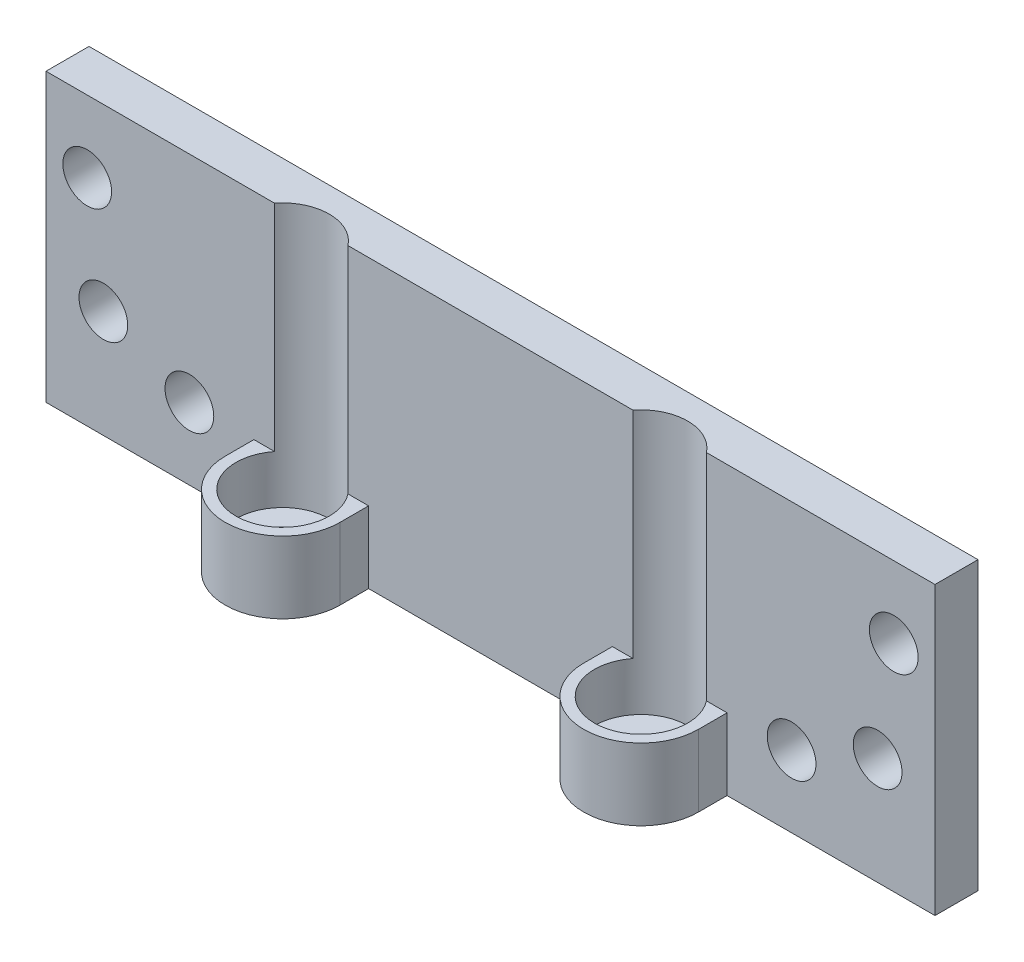
ISO-10303-21;
HEADER;
FILE_DESCRIPTION(('STEP AP214'),'2;1');
FILE_NAME('part.step','',(''),(''),'','','');
FILE_SCHEMA(('AUTOMOTIVE_DESIGN { 1 0 10303 214 1 1 1 1 }'));
ENDSEC;
DATA;
#1=APPLICATION_CONTEXT('core data for automotive mechanical design processes');
#2=APPLICATION_PROTOCOL_DEFINITION('international standard','automotive_design',2000,#1);
#3=PRODUCT_CONTEXT('',#1,'mechanical');
#4=PRODUCT('Part','Part','',(#3));
#5=PRODUCT_RELATED_PRODUCT_CATEGORY('part','',(#4));
#6=PRODUCT_DEFINITION_FORMATION('','',#4);
#7=PRODUCT_DEFINITION_CONTEXT('part definition',#1,'design');
#8=PRODUCT_DEFINITION('design','',#6,#7);
#9=PRODUCT_DEFINITION_SHAPE('','',#8);
#10=(LENGTH_UNIT() NAMED_UNIT(*) SI_UNIT(.MILLI.,.METRE.));
#11=(NAMED_UNIT(*) PLANE_ANGLE_UNIT() SI_UNIT($,.RADIAN.));
#12=(NAMED_UNIT(*) SI_UNIT($,.STERADIAN.) SOLID_ANGLE_UNIT());
#13=UNCERTAINTY_MEASURE_WITH_UNIT(LENGTH_MEASURE(1.E-05),#10,'distance_accuracy_value','');
#14=(GEOMETRIC_REPRESENTATION_CONTEXT(3) GLOBAL_UNCERTAINTY_ASSIGNED_CONTEXT((#13)) GLOBAL_UNIT_ASSIGNED_CONTEXT((#10,
#11,#12)) REPRESENTATION_CONTEXT('',''));
#15=CARTESIAN_POINT('',(0.,0.,0.));
#16=DIRECTION('',(0.,0.,1.));
#17=DIRECTION('',(1.,0.,0.));
#18=AXIS2_PLACEMENT_3D('',#15,#16,#17);
#19=CARTESIAN_POINT('',(16.5,20.,1.5));
#20=DIRECTION('',(0.,0.,-1.));
#21=DIRECTION('',(-1.,0.,0.));
#22=AXIS2_PLACEMENT_3D('',#19,#20,#21);
#23=PLANE('',#22);
#24=CARTESIAN_POINT('',(27.,7.5,1.5));
#25=DIRECTION('',(0.,0.,1.));
#26=DIRECTION('',(1.,0.,0.));
#27=AXIS2_PLACEMENT_3D('',#24,#25,#26);
#28=CIRCLE('',#27,1.69999999999999);
#29=CARTESIAN_POINT('',(28.7,7.5,1.5));
#30=VERTEX_POINT('',#29);
#31=EDGE_CURVE('E234',#30,#30,#28,.T.);
#32=ORIENTED_EDGE('',*,*,#31,.F.);
#33=EDGE_LOOP('',(#32));
#34=FACE_BOUND('',#33,.T.);
#35=DIRECTION('',(1.,0.,0.));
#36=VECTOR('',#35,1.);
#37=CARTESIAN_POINT('',(-31.,20.,1.5));
#38=LINE('',#37,#36);
#39=CARTESIAN_POINT('',(15.0617376914899,20.,1.5));
#40=VERTEX_POINT('',#39);
#41=CARTESIAN_POINT('',(31.,20.,1.5));
#42=VERTEX_POINT('',#41);
#43=EDGE_CURVE('E173',#40,#42,#38,.T.);
#44=ORIENTED_EDGE('',*,*,#43,.F.);
#45=DIRECTION('',(0.,-1.,0.));
#46=VECTOR('',#45,1.);
#47=CARTESIAN_POINT('',(15.0617376914899,25.2737557774322,1.5));
#48=LINE('',#47,#46);
#49=CARTESIAN_POINT('',(15.0617376914899,5.,1.5));
#50=VERTEX_POINT('',#49);
#51=EDGE_CURVE('E164',#40,#50,#48,.T.);
#52=ORIENTED_EDGE('',*,*,#51,.T.);
#53=DIRECTION('',(-1.,0.,0.));
#54=VECTOR('',#53,1.);
#55=CARTESIAN_POINT('',(-16.5,5.,1.5));
#56=LINE('',#55,#54);
#57=CARTESIAN_POINT('',(16.5,5.,1.5));
#58=VERTEX_POINT('',#57);
#59=EDGE_CURVE('E198',#58,#50,#56,.T.);
#60=ORIENTED_EDGE('',*,*,#59,.F.);
#61=DIRECTION('',(0.,-1.,0.));
#62=VECTOR('',#61,1.);
#63=CARTESIAN_POINT('',(16.5,20.,1.5));
#64=LINE('',#63,#62);
#65=CARTESIAN_POINT('',(16.5,0.,1.5));
#66=VERTEX_POINT('',#65);
#67=EDGE_CURVE('E175',#58,#66,#64,.T.);
#68=ORIENTED_EDGE('',*,*,#67,.T.);
#69=DIRECTION('',(1.,0.,0.));
#70=VECTOR('',#69,1.);
#71=CARTESIAN_POINT('',(16.5,0.,1.5));
#72=LINE('',#71,#70);
#73=CARTESIAN_POINT('',(31.,0.,1.5));
#74=VERTEX_POINT('',#73);
#75=EDGE_CURVE('E188',#66,#74,#72,.T.);
#76=ORIENTED_EDGE('',*,*,#75,.T.);
#77=DIRECTION('',(0.,-1.,0.));
#78=VECTOR('',#77,1.);
#79=CARTESIAN_POINT('',(31.,20.,1.5));
#80=LINE('',#79,#78);
#81=EDGE_CURVE('E170',#42,#74,#80,.T.);
#82=ORIENTED_EDGE('',*,*,#81,.F.);
#83=EDGE_LOOP('',(#44,#52,#60,#68,#76,#82));
#84=FACE_BOUND('',#83,.T.);
#85=CARTESIAN_POINT('',(21.,5.00000000000005,1.5));
#86=DIRECTION('',(0.,0.,1.));
#87=DIRECTION('',(1.,0.,0.));
#88=AXIS2_PLACEMENT_3D('',#85,#86,#87);
#89=CIRCLE('',#88,1.69999999999999);
#90=CARTESIAN_POINT('',(22.7,5.00000000000005,1.5));
#91=VERTEX_POINT('',#90);
#92=EDGE_CURVE('E246',#91,#91,#89,.T.);
#93=ORIENTED_EDGE('',*,*,#92,.F.);
#94=EDGE_LOOP('',(#93));
#95=FACE_BOUND('',#94,.T.);
#96=CARTESIAN_POINT('',(28.125,15.,1.5));
#97=DIRECTION('',(0.,0.,1.));
#98=DIRECTION('',(1.,0.,0.));
#99=AXIS2_PLACEMENT_3D('',#96,#97,#98);
#100=CIRCLE('',#99,1.69999999999999);
#101=CARTESIAN_POINT('',(29.825,15.,1.5));
#102=VERTEX_POINT('',#101);
#103=EDGE_CURVE('E258',#102,#102,#100,.T.);
#104=ORIENTED_EDGE('',*,*,#103,.F.);
#105=EDGE_LOOP('',(#104));
#106=FACE_BOUND('',#105,.T.);
#107=ADVANCED_FACE('F34',(#34,#84,#95,#106),#23,.F.);
#108=CARTESIAN_POINT('',(-9.9382623085101,20.,1.5));
#109=VERTEX_POINT('',#108);
#110=CARTESIAN_POINT('',(9.93826230851011,20.,1.5));
#111=VERTEX_POINT('',#110);
#112=EDGE_CURVE('E171',#109,#111,#38,.T.);
#113=ORIENTED_EDGE('',*,*,#112,.F.);
#114=DIRECTION('',(0.,-1.,0.));
#115=VECTOR('',#114,1.);
#116=CARTESIAN_POINT('',(-9.9382623085101,25.2737557774322,1.5));
#117=LINE('',#116,#115);
#118=CARTESIAN_POINT('',(-9.9382623085101,5.,1.5));
#119=VERTEX_POINT('',#118);
#120=EDGE_CURVE('E150',#109,#119,#117,.T.);
#121=ORIENTED_EDGE('',*,*,#120,.T.);
#122=CARTESIAN_POINT('',(-8.5,5.,1.5));
#123=VERTEX_POINT('',#122);
#124=EDGE_CURVE('E202',#123,#119,#56,.T.);
#125=ORIENTED_EDGE('',*,*,#124,.F.);
#126=DIRECTION('',(0.,-1.,0.));
#127=VECTOR('',#126,1.);
#128=CARTESIAN_POINT('',(-8.5,20.,1.5));
#129=LINE('',#128,#127);
#130=CARTESIAN_POINT('',(-8.5,0.,1.5));
#131=VERTEX_POINT('',#130);
#132=EDGE_CURVE('E400',#123,#131,#129,.T.);
#133=ORIENTED_EDGE('',*,*,#132,.T.);
#134=DIRECTION('',(1.,0.,0.));
#135=VECTOR('',#134,1.);
#136=CARTESIAN_POINT('',(-8.5,0.,1.5));
#137=LINE('',#136,#135);
#138=CARTESIAN_POINT('',(8.5,0.,1.5));
#139=VERTEX_POINT('',#138);
#140=EDGE_CURVE('E380',#131,#139,#137,.T.);
#141=ORIENTED_EDGE('',*,*,#140,.T.);
#142=DIRECTION('',(0.,-1.,0.));
#143=VECTOR('',#142,1.);
#144=CARTESIAN_POINT('',(8.5,20.,1.5));
#145=LINE('',#144,#143);
#146=CARTESIAN_POINT('',(8.5,5.,1.5));
#147=VERTEX_POINT('',#146);
#148=EDGE_CURVE('E398',#147,#139,#145,.T.);
#149=ORIENTED_EDGE('',*,*,#148,.F.);
#150=CARTESIAN_POINT('',(9.93826230851011,5.,1.5));
#151=VERTEX_POINT('',#150);
#152=EDGE_CURVE('E201',#151,#147,#56,.T.);
#153=ORIENTED_EDGE('',*,*,#152,.F.);
#154=DIRECTION('',(0.,-1.,0.));
#155=VECTOR('',#154,1.);
#156=CARTESIAN_POINT('',(9.93826230851011,25.2737557774322,1.5));
#157=LINE('',#156,#155);
#158=EDGE_CURVE('E58',#111,#151,#157,.T.);
#159=ORIENTED_EDGE('',*,*,#158,.F.);
#160=EDGE_LOOP('',(#113,#121,#125,#133,#141,#149,#153,#159));
#161=FACE_BOUND('',#160,.T.);
#162=ADVANCED_FACE('F274',(#161),#23,.F.);
#163=CARTESIAN_POINT('',(-16.5,20.,1.5));
#164=DIRECTION('',(1.,0.,0.));
#165=DIRECTION('',(0.,0.,-1.));
#166=AXIS2_PLACEMENT_3D('',#163,#164,#165);
#167=PLANE('',#166);
#168=DIRECTION('',(0.,0.,1.));
#169=VECTOR('',#168,1.);
#170=CARTESIAN_POINT('',(-16.5,5.,1.5));
#171=LINE('',#170,#169);
#172=CARTESIAN_POINT('',(-16.5,5.,1.5));
#173=VERTEX_POINT('',#172);
#174=CARTESIAN_POINT('',(-16.5,5.,3.5));
#175=VERTEX_POINT('',#174);
#176=EDGE_CURVE('E205',#173,#175,#171,.T.);
#177=ORIENTED_EDGE('',*,*,#176,.F.);
#178=DIRECTION('',(0.,-1.,0.));
#179=VECTOR('',#178,1.);
#180=CARTESIAN_POINT('',(-16.5,20.,1.5));
#181=LINE('',#180,#179);
#182=CARTESIAN_POINT('',(-16.5,0.,1.5));
#183=VERTEX_POINT('',#182);
#184=EDGE_CURVE('E406',#173,#183,#181,.T.);
#185=ORIENTED_EDGE('',*,*,#184,.T.);
#186=DIRECTION('',(0.,0.,1.));
#187=VECTOR('',#186,1.);
#188=CARTESIAN_POINT('',(-16.5,0.,1.5));
#189=LINE('',#188,#187);
#190=CARTESIAN_POINT('',(-16.5,0.,3.5));
#191=VERTEX_POINT('',#190);
#192=EDGE_CURVE('E369',#183,#191,#189,.T.);
#193=ORIENTED_EDGE('',*,*,#192,.T.);
#194=DIRECTION('',(0.,-1.,0.));
#195=VECTOR('',#194,1.);
#196=CARTESIAN_POINT('',(-16.5,20.,3.5));
#197=LINE('',#196,#195);
#198=EDGE_CURVE('E404',#175,#191,#197,.T.);
#199=ORIENTED_EDGE('',*,*,#198,.F.);
#200=EDGE_LOOP('',(#177,#185,#193,#199));
#201=FACE_BOUND('',#200,.T.);
#202=ADVANCED_FACE('F300',(#201),#167,.F.);
#203=CARTESIAN_POINT('',(-12.5,20.,3.5));
#204=DIRECTION('',(0.,-1.,0.));
#205=DIRECTION('',(0.,0.,-1.));
#206=AXIS2_PLACEMENT_3D('',#203,#204,#205);
#207=CYLINDRICAL_SURFACE('',#206,4.);
#208=DIRECTION('',(0.,-1.,0.));
#209=VECTOR('',#208,1.);
#210=CARTESIAN_POINT('',(-8.5,20.,3.5));
#211=LINE('',#210,#209);
#212=CARTESIAN_POINT('',(-8.5,5.,3.5));
#213=VERTEX_POINT('',#212);
#214=CARTESIAN_POINT('',(-8.5,0.,3.5));
#215=VERTEX_POINT('',#214);
#216=EDGE_CURVE('E402',#213,#215,#211,.T.);
#217=ORIENTED_EDGE('',*,*,#216,.F.);
#218=CARTESIAN_POINT('',(-12.5,5.,3.5));
#219=DIRECTION('',(0.,1.,0.));
#220=DIRECTION('',(0.,0.,1.));
#221=AXIS2_PLACEMENT_3D('',#218,#219,#220);
#222=CIRCLE('',#221,4.);
#223=EDGE_CURVE('E189',#175,#213,#222,.T.);
#224=ORIENTED_EDGE('',*,*,#223,.F.);
#225=ORIENTED_EDGE('',*,*,#198,.T.);
#226=CARTESIAN_POINT('',(-12.5,0.,3.5));
#227=DIRECTION('',(0.,1.,0.));
#228=DIRECTION('',(0.,0.,1.));
#229=AXIS2_PLACEMENT_3D('',#226,#227,#228);
#230=CIRCLE('',#229,4.);
#231=EDGE_CURVE('E374',#191,#215,#230,.T.);
#232=ORIENTED_EDGE('',*,*,#231,.T.);
#233=EDGE_LOOP('',(#217,#224,#225,#232));
#234=FACE_BOUND('',#233,.T.);
#235=ADVANCED_FACE('F323',(#234),#207,.T.);
#236=CARTESIAN_POINT('',(-8.5,20.,3.5));
#237=DIRECTION('',(-1.,0.,0.));
#238=DIRECTION('',(0.,0.,1.));
#239=AXIS2_PLACEMENT_3D('',#236,#237,#238);
#240=PLANE('',#239);
#241=DIRECTION('',(0.,0.,-1.));
#242=VECTOR('',#241,1.);
#243=CARTESIAN_POINT('',(-8.5,5.,3.5));
#244=LINE('',#243,#242);
#245=EDGE_CURVE('E192',#213,#123,#244,.T.);
#246=ORIENTED_EDGE('',*,*,#245,.F.);
#247=ORIENTED_EDGE('',*,*,#216,.T.);
#248=DIRECTION('',(0.,0.,-1.));
#249=VECTOR('',#248,1.);
#250=CARTESIAN_POINT('',(-8.5,0.,3.5));
#251=LINE('',#250,#249);
#252=EDGE_CURVE('E377',#215,#131,#251,.T.);
#253=ORIENTED_EDGE('',*,*,#252,.T.);
#254=ORIENTED_EDGE('',*,*,#132,.F.);
#255=EDGE_LOOP('',(#246,#247,#253,#254));
#256=FACE_BOUND('',#255,.T.);
#257=ADVANCED_FACE('F319',(#256),#240,.F.);
#258=CARTESIAN_POINT('',(8.5,20.,1.5));
#259=DIRECTION('',(1.,0.,0.));
#260=DIRECTION('',(0.,0.,-1.));
#261=AXIS2_PLACEMENT_3D('',#258,#259,#260);
#262=PLANE('',#261);
#263=DIRECTION('',(0.,0.,1.));
#264=VECTOR('',#263,1.);
#265=CARTESIAN_POINT('',(8.5,5.,1.5));
#266=LINE('',#265,#264);
#267=CARTESIAN_POINT('',(8.5,5.,3.5));
#268=VERTEX_POINT('',#267);
#269=EDGE_CURVE('E194',#147,#268,#266,.T.);
#270=ORIENTED_EDGE('',*,*,#269,.F.);
#271=ORIENTED_EDGE('',*,*,#148,.T.);
#272=DIRECTION('',(0.,0.,1.));
#273=VECTOR('',#272,1.);
#274=CARTESIAN_POINT('',(8.5,0.,1.5));
#275=LINE('',#274,#273);
#276=CARTESIAN_POINT('',(8.5,0.,3.5));
#277=VERTEX_POINT('',#276);
#278=EDGE_CURVE('E383',#139,#277,#275,.T.);
#279=ORIENTED_EDGE('',*,*,#278,.T.);
#280=DIRECTION('',(0.,-1.,0.));
#281=VECTOR('',#280,1.);
#282=CARTESIAN_POINT('',(8.5,20.,3.5));
#283=LINE('',#282,#281);
#284=EDGE_CURVE('E396',#268,#277,#283,.T.);
#285=ORIENTED_EDGE('',*,*,#284,.F.);
#286=EDGE_LOOP('',(#270,#271,#279,#285));
#287=FACE_BOUND('',#286,.T.);
#288=ADVANCED_FACE('F315',(#287),#262,.F.);
#289=CARTESIAN_POINT('',(12.5,20.,3.5));
#290=DIRECTION('',(0.,-1.,0.));
#291=DIRECTION('',(0.,0.,-1.));
#292=AXIS2_PLACEMENT_3D('',#289,#290,#291);
#293=CYLINDRICAL_SURFACE('',#292,4.);
#294=DIRECTION('',(0.,-1.,0.));
#295=VECTOR('',#294,1.);
#296=CARTESIAN_POINT('',(16.5,20.,3.5));
#297=LINE('',#296,#295);
#298=CARTESIAN_POINT('',(16.5,5.,3.5));
#299=VERTEX_POINT('',#298);
#300=CARTESIAN_POINT('',(16.5,0.,3.5));
#301=VERTEX_POINT('',#300);
#302=EDGE_CURVE('E394',#299,#301,#297,.T.);
#303=ORIENTED_EDGE('',*,*,#302,.F.);
#304=CARTESIAN_POINT('',(12.5,5.,3.5));
#305=DIRECTION('',(0.,1.,0.));
#306=DIRECTION('',(0.,0.,1.));
#307=AXIS2_PLACEMENT_3D('',#304,#305,#306);
#308=CIRCLE('',#307,4.);
#309=EDGE_CURVE('E196',#268,#299,#308,.T.);
#310=ORIENTED_EDGE('',*,*,#309,.F.);
#311=ORIENTED_EDGE('',*,*,#284,.T.);
#312=CARTESIAN_POINT('',(12.5,0.,3.5));
#313=DIRECTION('',(0.,1.,0.));
#314=DIRECTION('',(0.,0.,1.));
#315=AXIS2_PLACEMENT_3D('',#312,#313,#314);
#316=CIRCLE('',#315,4.);
#317=EDGE_CURVE('E386',#277,#301,#316,.T.);
#318=ORIENTED_EDGE('',*,*,#317,.T.);
#319=EDGE_LOOP('',(#303,#310,#311,#318));
#320=FACE_BOUND('',#319,.T.);
#321=ADVANCED_FACE('F311',(#320),#293,.T.);
#322=CARTESIAN_POINT('',(16.5,20.,3.5));
#323=DIRECTION('',(-1.,0.,0.));
#324=DIRECTION('',(0.,0.,1.));
#325=AXIS2_PLACEMENT_3D('',#322,#323,#324);
#326=PLANE('',#325);
#327=DIRECTION('',(0.,0.,-1.));
#328=VECTOR('',#327,1.);
#329=CARTESIAN_POINT('',(16.5,5.,1.5));
#330=LINE('',#329,#328);
#331=EDGE_CURVE('E203',#299,#58,#330,.T.);
#332=ORIENTED_EDGE('',*,*,#331,.F.);
#333=ORIENTED_EDGE('',*,*,#302,.T.);
#334=DIRECTION('',(0.,0.,-1.));
#335=VECTOR('',#334,1.);
#336=CARTESIAN_POINT('',(16.5,0.,3.5));
#337=LINE('',#336,#335);
#338=EDGE_CURVE('E389',#301,#66,#337,.T.);
#339=ORIENTED_EDGE('',*,*,#338,.T.);
#340=ORIENTED_EDGE('',*,*,#67,.F.);
#341=EDGE_LOOP('',(#332,#333,#339,#340));
#342=FACE_BOUND('',#341,.T.);
#343=ADVANCED_FACE('F308',(#342),#326,.F.);
#344=CARTESIAN_POINT('',(31.,20.,1.5));
#345=DIRECTION('',(-1.,0.,0.));
#346=DIRECTION('',(0.,0.,1.));
#347=AXIS2_PLACEMENT_3D('',#344,#345,#346);
#348=PLANE('',#347);
#349=DIRECTION('',(0.,0.,-1.));
#350=VECTOR('',#349,1.);
#351=CARTESIAN_POINT('',(31.,0.,1.5));
#352=LINE('',#351,#350);
#353=CARTESIAN_POINT('',(31.,0.,-1.5));
#354=VERTEX_POINT('',#353);
#355=EDGE_CURVE('E191',#74,#354,#352,.T.);
#356=ORIENTED_EDGE('',*,*,#355,.T.);
#357=DIRECTION('',(0.,-1.,0.));
#358=VECTOR('',#357,1.);
#359=CARTESIAN_POINT('',(31.,20.,-1.5));
#360=LINE('',#359,#358);
#361=CARTESIAN_POINT('',(31.,20.,-1.5));
#362=VERTEX_POINT('',#361);
#363=EDGE_CURVE('E38',#362,#354,#360,.T.);
#364=ORIENTED_EDGE('',*,*,#363,.F.);
#365=DIRECTION('',(0.,0.,-1.));
#366=VECTOR('',#365,1.);
#367=CARTESIAN_POINT('',(31.,20.,1.5));
#368=LINE('',#367,#366);
#369=EDGE_CURVE('E184',#42,#362,#368,.T.);
#370=ORIENTED_EDGE('',*,*,#369,.F.);
#371=ORIENTED_EDGE('',*,*,#81,.T.);
#372=EDGE_LOOP('',(#356,#364,#370,#371));
#373=FACE_BOUND('',#372,.T.);
#374=ADVANCED_FACE('F36',(#373),#348,.F.);
#375=CARTESIAN_POINT('',(-31.,20.,-1.5));
#376=DIRECTION('',(0.,0.,1.));
#377=DIRECTION('',(1.,0.,0.));
#378=AXIS2_PLACEMENT_3D('',#375,#376,#377);
#379=PLANE('',#378);
#380=CARTESIAN_POINT('',(-28.125,15.,-1.5));
#381=DIRECTION('',(0.,0.,1.));
#382=DIRECTION('',(1.,0.,0.));
#383=AXIS2_PLACEMENT_3D('',#380,#381,#382);
#384=CIRCLE('',#383,1.69999999999999);
#385=CARTESIAN_POINT('',(-26.425,15.,-1.5));
#386=VERTEX_POINT('',#385);
#387=EDGE_CURVE('E261',#386,#386,#384,.T.);
#388=ORIENTED_EDGE('',*,*,#387,.T.);
#389=EDGE_LOOP('',(#388));
#390=FACE_BOUND('',#389,.T.);
#391=CARTESIAN_POINT('',(28.125,15.,-1.5));
#392=DIRECTION('',(0.,0.,1.));
#393=DIRECTION('',(1.,0.,0.));
#394=AXIS2_PLACEMENT_3D('',#391,#392,#393);
#395=CIRCLE('',#394,1.69999999999999);
#396=CARTESIAN_POINT('',(29.825,15.,-1.5));
#397=VERTEX_POINT('',#396);
#398=EDGE_CURVE('E255',#397,#397,#395,.T.);
#399=ORIENTED_EDGE('',*,*,#398,.T.);
#400=EDGE_LOOP('',(#399));
#401=FACE_BOUND('',#400,.T.);
#402=CARTESIAN_POINT('',(-21.,5.,-1.5));
#403=DIRECTION('',(0.,0.,1.));
#404=DIRECTION('',(1.,0.,0.));
#405=AXIS2_PLACEMENT_3D('',#402,#403,#404);
#406=CIRCLE('',#405,1.69999999999999);
#407=CARTESIAN_POINT('',(-19.3,5.,-1.5));
#408=VERTEX_POINT('',#407);
#409=EDGE_CURVE('E249',#408,#408,#406,.T.);
#410=ORIENTED_EDGE('',*,*,#409,.T.);
#411=EDGE_LOOP('',(#410));
#412=FACE_BOUND('',#411,.T.);
#413=CARTESIAN_POINT('',(21.,5.00000000000005,-1.5));
#414=DIRECTION('',(0.,0.,1.));
#415=DIRECTION('',(1.,0.,0.));
#416=AXIS2_PLACEMENT_3D('',#413,#414,#415);
#417=CIRCLE('',#416,1.69999999999999);
#418=CARTESIAN_POINT('',(22.7,5.00000000000005,-1.5));
#419=VERTEX_POINT('',#418);
#420=EDGE_CURVE('E243',#419,#419,#417,.T.);
#421=ORIENTED_EDGE('',*,*,#420,.T.);
#422=EDGE_LOOP('',(#421));
#423=FACE_BOUND('',#422,.T.);
#424=CARTESIAN_POINT('',(-27.,7.5,-1.5));
#425=DIRECTION('',(0.,0.,1.));
#426=DIRECTION('',(1.,0.,0.));
#427=AXIS2_PLACEMENT_3D('',#424,#425,#426);
#428=CIRCLE('',#427,1.69999999999999);
#429=CARTESIAN_POINT('',(-25.3,7.5,-1.5));
#430=VERTEX_POINT('',#429);
#431=EDGE_CURVE('E237',#430,#430,#428,.T.);
#432=ORIENTED_EDGE('',*,*,#431,.T.);
#433=EDGE_LOOP('',(#432));
#434=FACE_BOUND('',#433,.T.);
#435=CARTESIAN_POINT('',(27.,7.5,-1.5));
#436=DIRECTION('',(0.,0.,1.));
#437=DIRECTION('',(1.,0.,0.));
#438=AXIS2_PLACEMENT_3D('',#435,#436,#437);
#439=CIRCLE('',#438,1.69999999999999);
#440=CARTESIAN_POINT('',(28.7,7.5,-1.5));
#441=VERTEX_POINT('',#440);
#442=EDGE_CURVE('E229',#441,#441,#439,.T.);
#443=ORIENTED_EDGE('',*,*,#442,.T.);
#444=EDGE_LOOP('',(#443));
#445=FACE_BOUND('',#444,.T.);
#446=DIRECTION('',(-1.,0.,0.));
#447=VECTOR('',#446,1.);
#448=CARTESIAN_POINT('',(-31.,0.,-1.5));
#449=LINE('',#448,#447);
#450=CARTESIAN_POINT('',(-31.,0.,-1.5));
#451=VERTEX_POINT('',#450);
#452=EDGE_CURVE('E353',#354,#451,#449,.T.);
#453=ORIENTED_EDGE('',*,*,#452,.T.);
#454=DIRECTION('',(0.,-1.,0.));
#455=VECTOR('',#454,1.);
#456=CARTESIAN_POINT('',(-31.,20.,-1.5));
#457=LINE('',#456,#455);
#458=CARTESIAN_POINT('',(-31.,20.,-1.5));
#459=VERTEX_POINT('',#458);
#460=EDGE_CURVE('E355',#459,#451,#457,.T.);
#461=ORIENTED_EDGE('',*,*,#460,.F.);
#462=DIRECTION('',(-1.,0.,0.));
#463=VECTOR('',#462,1.);
#464=CARTESIAN_POINT('',(-31.,20.,-1.5));
#465=LINE('',#464,#463);
#466=EDGE_CURVE('E183',#362,#459,#465,.T.);
#467=ORIENTED_EDGE('',*,*,#466,.F.);
#468=ORIENTED_EDGE('',*,*,#363,.T.);
#469=EDGE_LOOP('',(#453,#461,#467,#468));
#470=FACE_BOUND('',#469,.T.);
#471=ADVANCED_FACE('F332',(#390,#401,#412,#423,#434,#445,#470),#379,.F.);
#472=CARTESIAN_POINT('',(-31.,20.,1.5));
#473=DIRECTION('',(1.,0.,0.));
#474=DIRECTION('',(0.,0.,-1.));
#475=AXIS2_PLACEMENT_3D('',#472,#473,#474);
#476=PLANE('',#475);
#477=DIRECTION('',(0.,0.,1.));
#478=VECTOR('',#477,1.);
#479=CARTESIAN_POINT('',(-31.,0.,1.5));
#480=LINE('',#479,#478);
#481=CARTESIAN_POINT('',(-31.,0.,1.5));
#482=VERTEX_POINT('',#481);
#483=EDGE_CURVE('E361',#451,#482,#480,.T.);
#484=ORIENTED_EDGE('',*,*,#483,.T.);
#485=DIRECTION('',(0.,-1.,0.));
#486=VECTOR('',#485,1.);
#487=CARTESIAN_POINT('',(-31.,20.,1.5));
#488=LINE('',#487,#486);
#489=CARTESIAN_POINT('',(-31.,20.,1.5));
#490=VERTEX_POINT('',#489);
#491=EDGE_CURVE('E363',#490,#482,#488,.T.);
#492=ORIENTED_EDGE('',*,*,#491,.F.);
#493=DIRECTION('',(0.,0.,1.));
#494=VECTOR('',#493,1.);
#495=CARTESIAN_POINT('',(-31.,20.,1.5));
#496=LINE('',#495,#494);
#497=EDGE_CURVE('E168',#459,#490,#496,.T.);
#498=ORIENTED_EDGE('',*,*,#497,.F.);
#499=ORIENTED_EDGE('',*,*,#460,.T.);
#500=EDGE_LOOP('',(#484,#492,#498,#499));
#501=FACE_BOUND('',#500,.T.);
#502=ADVANCED_FACE('F272',(#501),#476,.F.);
#503=CARTESIAN_POINT('',(-28.125,15.,1.5));
#504=DIRECTION('',(0.,0.,1.));
#505=DIRECTION('',(1.,0.,0.));
#506=AXIS2_PLACEMENT_3D('',#503,#504,#505);
#507=CIRCLE('',#506,1.69999999999999);
#508=CARTESIAN_POINT('',(-26.425,15.,1.5));
#509=VERTEX_POINT('',#508);
#510=EDGE_CURVE('E264',#509,#509,#507,.T.);
#511=ORIENTED_EDGE('',*,*,#510,.F.);
#512=EDGE_LOOP('',(#511));
#513=FACE_BOUND('',#512,.T.);
#514=CARTESIAN_POINT('',(-21.,5.,1.5));
#515=DIRECTION('',(0.,0.,1.));
#516=DIRECTION('',(1.,0.,0.));
#517=AXIS2_PLACEMENT_3D('',#514,#515,#516);
#518=CIRCLE('',#517,1.69999999999999);
#519=CARTESIAN_POINT('',(-19.3,5.,1.5));
#520=VERTEX_POINT('',#519);
#521=EDGE_CURVE('E252',#520,#520,#518,.T.);
#522=ORIENTED_EDGE('',*,*,#521,.F.);
#523=EDGE_LOOP('',(#522));
#524=FACE_BOUND('',#523,.T.);
#525=CARTESIAN_POINT('',(-27.,7.5,1.5));
#526=DIRECTION('',(0.,0.,1.));
#527=DIRECTION('',(1.,0.,0.));
#528=AXIS2_PLACEMENT_3D('',#525,#526,#527);
#529=CIRCLE('',#528,1.69999999999999);
#530=CARTESIAN_POINT('',(-25.3,7.5,1.5));
#531=VERTEX_POINT('',#530);
#532=EDGE_CURVE('E240',#531,#531,#529,.T.);
#533=ORIENTED_EDGE('',*,*,#532,.F.);
#534=EDGE_LOOP('',(#533));
#535=FACE_BOUND('',#534,.T.);
#536=CARTESIAN_POINT('',(-15.0617376914899,5.,1.5));
#537=VERTEX_POINT('',#536);
#538=EDGE_CURVE('E163',#537,#173,#56,.T.);
#539=ORIENTED_EDGE('',*,*,#538,.F.);
#540=DIRECTION('',(0.,-1.,0.));
#541=VECTOR('',#540,1.);
#542=CARTESIAN_POINT('',(-15.0617376914899,25.2737557774322,1.5));
#543=LINE('',#542,#541);
#544=CARTESIAN_POINT('',(-15.0617376914899,20.,1.5));
#545=VERTEX_POINT('',#544);
#546=EDGE_CURVE('E50',#545,#537,#543,.T.);
#547=ORIENTED_EDGE('',*,*,#546,.F.);
#548=EDGE_CURVE('E161',#490,#545,#38,.T.);
#549=ORIENTED_EDGE('',*,*,#548,.F.);
#550=ORIENTED_EDGE('',*,*,#491,.T.);
#551=DIRECTION('',(1.,0.,0.));
#552=VECTOR('',#551,1.);
#553=CARTESIAN_POINT('',(-31.,0.,1.5));
#554=LINE('',#553,#552);
#555=EDGE_CURVE('E367',#482,#183,#554,.T.);
#556=ORIENTED_EDGE('',*,*,#555,.T.);
#557=ORIENTED_EDGE('',*,*,#184,.F.);
#558=EDGE_LOOP('',(#539,#547,#549,#550,#556,#557));
#559=FACE_BOUND('',#558,.T.);
#560=ADVANCED_FACE('F159',(#513,#524,#535,#559),#23,.F.);
#561=CARTESIAN_POINT('',(-12.5,20.,3.5));
#562=DIRECTION('',(0.,1.,0.));
#563=DIRECTION('',(0.,0.,1.));
#564=AXIS2_PLACEMENT_3D('',#561,#562,#563);
#565=PLANE('',#564);
#566=CARTESIAN_POINT('',(-12.5,20.,3.5));
#567=DIRECTION('',(0.,1.,0.));
#568=DIRECTION('',(0.,0.,1.));
#569=AXIS2_PLACEMENT_3D('',#566,#567,#568);
#570=CIRCLE('',#569,3.25);
#571=EDGE_CURVE('E148',#545,#109,#570,.F.);
#572=ORIENTED_EDGE('',*,*,#571,.T.);
#573=ORIENTED_EDGE('',*,*,#112,.T.);
#574=CARTESIAN_POINT('',(12.5,20.,3.5));
#575=DIRECTION('',(0.,1.,0.));
#576=DIRECTION('',(0.,0.,1.));
#577=AXIS2_PLACEMENT_3D('',#574,#575,#576);
#578=CIRCLE('',#577,3.25);
#579=EDGE_CURVE('E227',#111,#40,#578,.F.);
#580=ORIENTED_EDGE('',*,*,#579,.T.);
#581=ORIENTED_EDGE('',*,*,#43,.T.);
#582=ORIENTED_EDGE('',*,*,#369,.T.);
#583=ORIENTED_EDGE('',*,*,#466,.T.);
#584=ORIENTED_EDGE('',*,*,#497,.T.);
#585=ORIENTED_EDGE('',*,*,#548,.T.);
#586=EDGE_LOOP('',(#572,#573,#580,#581,#582,#583,#584,#585));
#587=FACE_BOUND('',#586,.T.);
#588=ADVANCED_FACE('F166',(#587),#565,.T.);
#589=CARTESIAN_POINT('',(-12.5,0.,3.5));
#590=DIRECTION('',(0.,1.,0.));
#591=DIRECTION('',(0.,0.,1.));
#592=AXIS2_PLACEMENT_3D('',#589,#590,#591);
#593=PLANE('',#592);
#594=CARTESIAN_POINT('',(-12.5,0.,3.5));
#595=DIRECTION('',(0.,1.,0.));
#596=DIRECTION('',(0.,0.,1.));
#597=AXIS2_PLACEMENT_3D('',#594,#595,#596);
#598=CIRCLE('',#597,1.6);
#599=CARTESIAN_POINT('',(-12.5,0.,5.1));
#600=VERTEX_POINT('',#599);
#601=EDGE_CURVE('E216',#600,#600,#598,.T.);
#602=ORIENTED_EDGE('',*,*,#601,.T.);
#603=EDGE_LOOP('',(#602));
#604=FACE_BOUND('',#603,.T.);
#605=CARTESIAN_POINT('',(12.5,0.,3.5));
#606=DIRECTION('',(0.,1.,0.));
#607=DIRECTION('',(0.,0.,1.));
#608=AXIS2_PLACEMENT_3D('',#605,#606,#607);
#609=CIRCLE('',#608,1.6);
#610=CARTESIAN_POINT('',(12.5,0.,5.1));
#611=VERTEX_POINT('',#610);
#612=EDGE_CURVE('E207',#611,#611,#609,.T.);
#613=ORIENTED_EDGE('',*,*,#612,.T.);
#614=EDGE_LOOP('',(#613));
#615=FACE_BOUND('',#614,.T.);
#616=ORIENTED_EDGE('',*,*,#355,.F.);
#617=ORIENTED_EDGE('',*,*,#75,.F.);
#618=ORIENTED_EDGE('',*,*,#338,.F.);
#619=ORIENTED_EDGE('',*,*,#317,.F.);
#620=ORIENTED_EDGE('',*,*,#278,.F.);
#621=ORIENTED_EDGE('',*,*,#140,.F.);
#622=ORIENTED_EDGE('',*,*,#252,.F.);
#623=ORIENTED_EDGE('',*,*,#231,.F.);
#624=ORIENTED_EDGE('',*,*,#192,.F.);
#625=ORIENTED_EDGE('',*,*,#555,.F.);
#626=ORIENTED_EDGE('',*,*,#483,.F.);
#627=ORIENTED_EDGE('',*,*,#452,.F.);
#628=EDGE_LOOP('',(#616,#617,#618,#619,#620,#621,#622,#623,#624,#625,#626,#627));
#629=FACE_BOUND('',#628,.T.);
#630=ADVANCED_FACE('F306',(#604,#615,#629),#593,.F.);
#631=CARTESIAN_POINT('',(0.,5.,0.));
#632=DIRECTION('',(0.,1.,0.));
#633=DIRECTION('',(0.,0.,1.));
#634=AXIS2_PLACEMENT_3D('',#631,#632,#633);
#635=PLANE('',#634);
#636=CARTESIAN_POINT('',(-12.5,5.,3.5));
#637=DIRECTION('',(0.,1.,0.));
#638=DIRECTION('',(0.,0.,1.));
#639=AXIS2_PLACEMENT_3D('',#636,#637,#638);
#640=CIRCLE('',#639,3.25);
#641=EDGE_CURVE('E11',#537,#119,#640,.T.);
#642=ORIENTED_EDGE('',*,*,#641,.F.);
#643=ORIENTED_EDGE('',*,*,#538,.T.);
#644=ORIENTED_EDGE('',*,*,#176,.T.);
#645=ORIENTED_EDGE('',*,*,#223,.T.);
#646=ORIENTED_EDGE('',*,*,#245,.T.);
#647=ORIENTED_EDGE('',*,*,#124,.T.);
#648=EDGE_LOOP('',(#642,#643,#644,#645,#646,#647));
#649=FACE_BOUND('',#648,.T.);
#650=ADVANCED_FACE('F414',(#649),#635,.T.);
#651=CARTESIAN_POINT('',(12.5,5.,3.5));
#652=DIRECTION('',(0.,1.,0.));
#653=DIRECTION('',(0.,0.,1.));
#654=AXIS2_PLACEMENT_3D('',#651,#652,#653);
#655=CIRCLE('',#654,3.25);
#656=EDGE_CURVE('E43',#151,#50,#655,.T.);
#657=ORIENTED_EDGE('',*,*,#656,.F.);
#658=ORIENTED_EDGE('',*,*,#152,.T.);
#659=ORIENTED_EDGE('',*,*,#269,.T.);
#660=ORIENTED_EDGE('',*,*,#309,.T.);
#661=ORIENTED_EDGE('',*,*,#331,.T.);
#662=ORIENTED_EDGE('',*,*,#59,.T.);
#663=EDGE_LOOP('',(#657,#658,#659,#660,#661,#662));
#664=FACE_BOUND('',#663,.T.);
#665=ADVANCED_FACE('F424',(#664),#635,.T.);
#666=CARTESIAN_POINT('',(12.5,5.,3.5));
#667=DIRECTION('',(0.,1.,0.));
#668=DIRECTION('',(0.,0.,1.));
#669=AXIS2_PLACEMENT_3D('',#666,#667,#668);
#670=CYLINDRICAL_SURFACE('',#669,1.6);
#671=ORIENTED_EDGE('',*,*,#612,.F.);
#672=EDGE_LOOP('',(#671));
#673=FACE_BOUND('',#672,.T.);
#674=CARTESIAN_POINT('',(12.5,1.6,3.5));
#675=DIRECTION('',(0.,1.,0.));
#676=DIRECTION('',(0.,0.,1.));
#677=AXIS2_PLACEMENT_3D('',#674,#675,#676);
#678=CIRCLE('',#677,1.6);
#679=CARTESIAN_POINT('',(12.5,1.6,5.1));
#680=VERTEX_POINT('',#679);
#681=EDGE_CURVE('E210',#680,#680,#678,.T.);
#682=ORIENTED_EDGE('',*,*,#681,.T.);
#683=EDGE_LOOP('',(#682));
#684=FACE_BOUND('',#683,.T.);
#685=ADVANCED_FACE('F450',(#673,#684),#670,.F.);
#686=CARTESIAN_POINT('',(14.1,1.6,3.5));
#687=DIRECTION('',(0.,-1.,0.));
#688=DIRECTION('',(0.,0.,-1.));
#689=AXIS2_PLACEMENT_3D('',#686,#687,#688);
#690=PLANE('',#689);
#691=ORIENTED_EDGE('',*,*,#681,.F.);
#692=EDGE_LOOP('',(#691));
#693=FACE_BOUND('',#692,.T.);
#694=CARTESIAN_POINT('',(12.5,1.6,3.5));
#695=DIRECTION('',(0.,1.,0.));
#696=DIRECTION('',(0.,0.,1.));
#697=AXIS2_PLACEMENT_3D('',#694,#695,#696);
#698=CIRCLE('',#697,3.25);
#699=CARTESIAN_POINT('',(12.5,1.6,6.75));
#700=VERTEX_POINT('',#699);
#701=EDGE_CURVE('E213',#700,#700,#698,.T.);
#702=ORIENTED_EDGE('',*,*,#701,.T.);
#703=EDGE_LOOP('',(#702));
#704=FACE_BOUND('',#703,.T.);
#705=ADVANCED_FACE('F440',(#693,#704),#690,.F.);
#706=CARTESIAN_POINT('',(12.5,5.,3.5));
#707=DIRECTION('',(0.,1.,0.));
#708=DIRECTION('',(0.,0.,1.));
#709=AXIS2_PLACEMENT_3D('',#706,#707,#708);
#710=CYLINDRICAL_SURFACE('',#709,3.25);
#711=ORIENTED_EDGE('',*,*,#701,.F.);
#712=EDGE_LOOP('',(#711));
#713=FACE_BOUND('',#712,.T.);
#714=ORIENTED_EDGE('',*,*,#656,.T.);
#715=ORIENTED_EDGE('',*,*,#51,.F.);
#716=ORIENTED_EDGE('',*,*,#579,.F.);
#717=ORIENTED_EDGE('',*,*,#158,.T.);
#718=EDGE_LOOP('',(#714,#715,#716,#717));
#719=FACE_BOUND('',#718,.T.);
#720=ADVANCED_FACE('F437',(#713,#719),#710,.F.);
#721=CARTESIAN_POINT('',(-12.5,5.,3.5));
#722=DIRECTION('',(0.,1.,0.));
#723=DIRECTION('',(0.,0.,1.));
#724=AXIS2_PLACEMENT_3D('',#721,#722,#723);
#725=CYLINDRICAL_SURFACE('',#724,1.6);
#726=ORIENTED_EDGE('',*,*,#601,.F.);
#727=EDGE_LOOP('',(#726));
#728=FACE_BOUND('',#727,.T.);
#729=CARTESIAN_POINT('',(-12.5,1.6,3.5));
#730=DIRECTION('',(0.,1.,0.));
#731=DIRECTION('',(0.,0.,1.));
#732=AXIS2_PLACEMENT_3D('',#729,#730,#731);
#733=CIRCLE('',#732,1.6);
#734=CARTESIAN_POINT('',(-12.5,1.6,5.1));
#735=VERTEX_POINT('',#734);
#736=EDGE_CURVE('E220',#735,#735,#733,.T.);
#737=ORIENTED_EDGE('',*,*,#736,.T.);
#738=EDGE_LOOP('',(#737));
#739=FACE_BOUND('',#738,.T.);
#740=ADVANCED_FACE('F439',(#728,#739),#725,.F.);
#741=CARTESIAN_POINT('',(-10.9,1.6,3.5));
#742=DIRECTION('',(0.,-1.,0.));
#743=DIRECTION('',(0.,0.,-1.));
#744=AXIS2_PLACEMENT_3D('',#741,#742,#743);
#745=PLANE('',#744);
#746=ORIENTED_EDGE('',*,*,#736,.F.);
#747=EDGE_LOOP('',(#746));
#748=FACE_BOUND('',#747,.T.);
#749=CARTESIAN_POINT('',(-12.5,1.6,3.5));
#750=DIRECTION('',(0.,1.,0.));
#751=DIRECTION('',(0.,0.,1.));
#752=AXIS2_PLACEMENT_3D('',#749,#750,#751);
#753=CIRCLE('',#752,3.25);
#754=CARTESIAN_POINT('',(-12.5,1.6,6.75));
#755=VERTEX_POINT('',#754);
#756=EDGE_CURVE('E223',#755,#755,#753,.T.);
#757=ORIENTED_EDGE('',*,*,#756,.T.);
#758=EDGE_LOOP('',(#757));
#759=FACE_BOUND('',#758,.T.);
#760=ADVANCED_FACE('F447',(#748,#759),#745,.F.);
#761=CARTESIAN_POINT('',(-12.5,5.,3.5));
#762=DIRECTION('',(0.,1.,0.));
#763=DIRECTION('',(0.,0.,1.));
#764=AXIS2_PLACEMENT_3D('',#761,#762,#763);
#765=CYLINDRICAL_SURFACE('',#764,3.25);
#766=ORIENTED_EDGE('',*,*,#756,.F.);
#767=EDGE_LOOP('',(#766));
#768=FACE_BOUND('',#767,.T.);
#769=ORIENTED_EDGE('',*,*,#641,.T.);
#770=ORIENTED_EDGE('',*,*,#120,.F.);
#771=ORIENTED_EDGE('',*,*,#571,.F.);
#772=ORIENTED_EDGE('',*,*,#546,.T.);
#773=EDGE_LOOP('',(#769,#770,#771,#772));
#774=FACE_BOUND('',#773,.T.);
#775=ADVANCED_FACE('F149',(#768,#774),#765,.F.);
#776=CARTESIAN_POINT('',(27.,7.5,1.5));
#777=DIRECTION('',(0.,0.,1.));
#778=DIRECTION('',(1.,0.,0.));
#779=AXIS2_PLACEMENT_3D('',#776,#777,#778);
#780=CYLINDRICAL_SURFACE('',#779,1.69999999999999);
#781=ORIENTED_EDGE('',*,*,#442,.F.);
#782=EDGE_LOOP('',(#781));
#783=FACE_BOUND('',#782,.T.);
#784=ORIENTED_EDGE('',*,*,#31,.T.);
#785=EDGE_LOOP('',(#784));
#786=FACE_BOUND('',#785,.T.);
#787=ADVANCED_FACE('F282',(#783,#786),#780,.F.);
#788=CARTESIAN_POINT('',(-27.,7.5,1.5));
#789=DIRECTION('',(0.,0.,1.));
#790=DIRECTION('',(1.,0.,0.));
#791=AXIS2_PLACEMENT_3D('',#788,#789,#790);
#792=CYLINDRICAL_SURFACE('',#791,1.69999999999999);
#793=ORIENTED_EDGE('',*,*,#431,.F.);
#794=EDGE_LOOP('',(#793));
#795=FACE_BOUND('',#794,.T.);
#796=ORIENTED_EDGE('',*,*,#532,.T.);
#797=EDGE_LOOP('',(#796));
#798=FACE_BOUND('',#797,.T.);
#799=ADVANCED_FACE('F279',(#795,#798),#792,.F.);
#800=CARTESIAN_POINT('',(21.,5.00000000000005,1.5));
#801=DIRECTION('',(0.,0.,1.));
#802=DIRECTION('',(1.,0.,0.));
#803=AXIS2_PLACEMENT_3D('',#800,#801,#802);
#804=CYLINDRICAL_SURFACE('',#803,1.69999999999999);
#805=ORIENTED_EDGE('',*,*,#420,.F.);
#806=EDGE_LOOP('',(#805));
#807=FACE_BOUND('',#806,.T.);
#808=ORIENTED_EDGE('',*,*,#92,.T.);
#809=EDGE_LOOP('',(#808));
#810=FACE_BOUND('',#809,.T.);
#811=ADVANCED_FACE('F281',(#807,#810),#804,.F.);
#812=CARTESIAN_POINT('',(-21.,5.,1.5));
#813=DIRECTION('',(0.,0.,1.));
#814=DIRECTION('',(1.,0.,0.));
#815=AXIS2_PLACEMENT_3D('',#812,#813,#814);
#816=CYLINDRICAL_SURFACE('',#815,1.69999999999999);
#817=ORIENTED_EDGE('',*,*,#409,.F.);
#818=EDGE_LOOP('',(#817));
#819=FACE_BOUND('',#818,.T.);
#820=ORIENTED_EDGE('',*,*,#521,.T.);
#821=EDGE_LOOP('',(#820));
#822=FACE_BOUND('',#821,.T.);
#823=ADVANCED_FACE('F289',(#819,#822),#816,.F.);
#824=CARTESIAN_POINT('',(28.125,15.,1.5));
#825=DIRECTION('',(0.,0.,1.));
#826=DIRECTION('',(1.,0.,0.));
#827=AXIS2_PLACEMENT_3D('',#824,#825,#826);
#828=CYLINDRICAL_SURFACE('',#827,1.69999999999999);
#829=ORIENTED_EDGE('',*,*,#398,.F.);
#830=EDGE_LOOP('',(#829));
#831=FACE_BOUND('',#830,.T.);
#832=ORIENTED_EDGE('',*,*,#103,.T.);
#833=EDGE_LOOP('',(#832));
#834=FACE_BOUND('',#833,.T.);
#835=ADVANCED_FACE('F513',(#831,#834),#828,.F.);
#836=CARTESIAN_POINT('',(-28.125,15.,1.5));
#837=DIRECTION('',(0.,0.,1.));
#838=DIRECTION('',(1.,0.,0.));
#839=AXIS2_PLACEMENT_3D('',#836,#837,#838);
#840=CYLINDRICAL_SURFACE('',#839,1.69999999999999);
#841=ORIENTED_EDGE('',*,*,#387,.F.);
#842=EDGE_LOOP('',(#841));
#843=FACE_BOUND('',#842,.T.);
#844=ORIENTED_EDGE('',*,*,#510,.T.);
#845=EDGE_LOOP('',(#844));
#846=FACE_BOUND('',#845,.T.);
#847=ADVANCED_FACE('F268',(#843,#846),#840,.F.);
#848=CLOSED_SHELL('',(#107,#162,#202,#235,#257,#288,#321,#343,#374,#471,#502,#560,#588,#630,
#650,#665,#685,#705,#720,#740,#760,#775,#787,#799,#811,#823,#835,#847));
#849=MANIFOLD_SOLID_BREP('B2',#848);
#850=ADVANCED_BREP_SHAPE_REPRESENTATION('',(#18,#849),#14);
#851=SHAPE_DEFINITION_REPRESENTATION(#9,#850);
ENDSEC;
END-ISO-10303-21;
